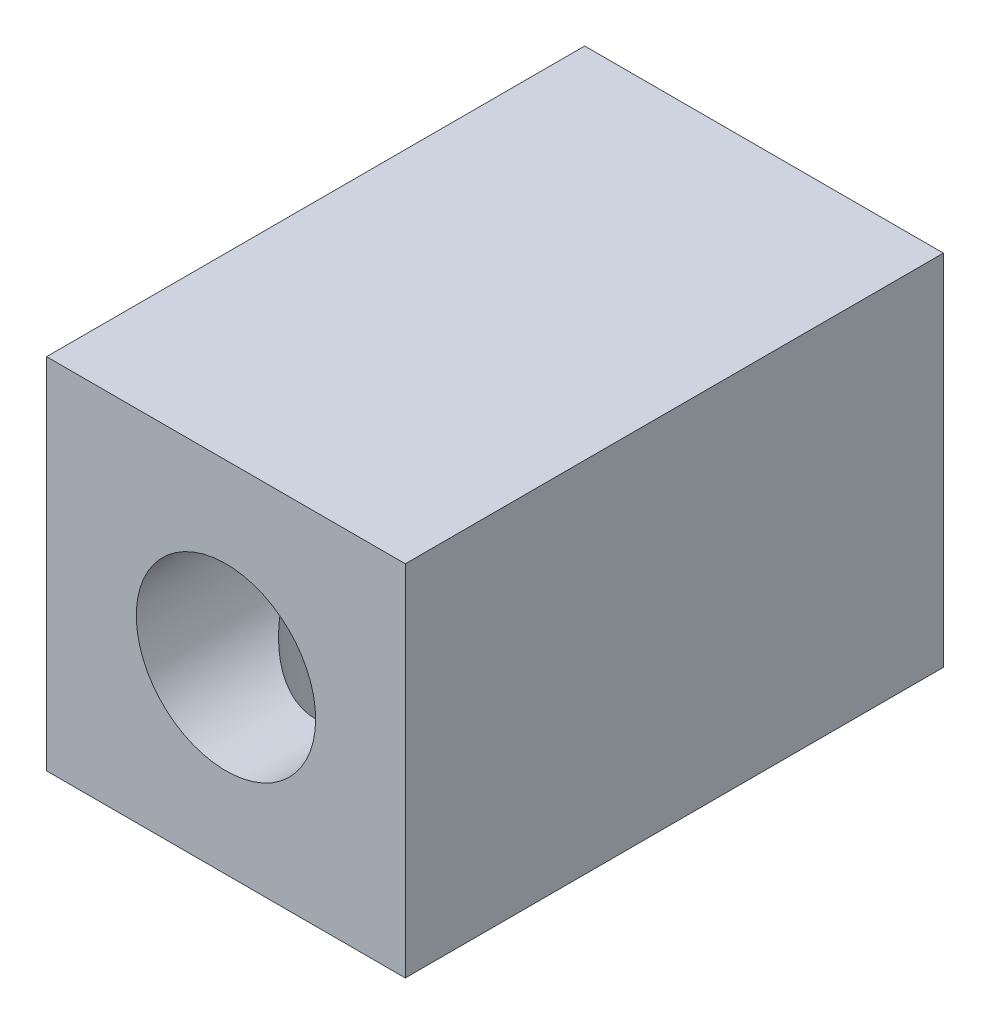
ISO-10303-21;
HEADER;
FILE_DESCRIPTION(('STEP AP214'),'2;1');
FILE_NAME('part.step','',(''),(''),'','','');
FILE_SCHEMA(('AUTOMOTIVE_DESIGN { 1 0 10303 214 1 1 1 1 }'));
ENDSEC;
DATA;
#1=APPLICATION_CONTEXT('core data for automotive mechanical design processes');
#2=APPLICATION_PROTOCOL_DEFINITION('international standard','automotive_design',2000,#1);
#3=PRODUCT_CONTEXT('',#1,'mechanical');
#4=PRODUCT('Part','Part','',(#3));
#5=PRODUCT_RELATED_PRODUCT_CATEGORY('part','',(#4));
#6=PRODUCT_DEFINITION_FORMATION('','',#4);
#7=PRODUCT_DEFINITION_CONTEXT('part definition',#1,'design');
#8=PRODUCT_DEFINITION('design','',#6,#7);
#9=PRODUCT_DEFINITION_SHAPE('','',#8);
#10=(LENGTH_UNIT() NAMED_UNIT(*) SI_UNIT(.MILLI.,.METRE.));
#11=(NAMED_UNIT(*) PLANE_ANGLE_UNIT() SI_UNIT($,.RADIAN.));
#12=(NAMED_UNIT(*) SI_UNIT($,.STERADIAN.) SOLID_ANGLE_UNIT());
#13=UNCERTAINTY_MEASURE_WITH_UNIT(LENGTH_MEASURE(1.E-05),#10,'distance_accuracy_value','');
#14=(GEOMETRIC_REPRESENTATION_CONTEXT(3) GLOBAL_UNCERTAINTY_ASSIGNED_CONTEXT((#13)) GLOBAL_UNIT_ASSIGNED_CONTEXT((#10,
#11,#12)) REPRESENTATION_CONTEXT('',''));
#15=CARTESIAN_POINT('',(0.,0.,0.));
#16=DIRECTION('',(0.,0.,1.));
#17=DIRECTION('',(1.,0.,0.));
#18=AXIS2_PLACEMENT_3D('',#15,#16,#17);
#19=CARTESIAN_POINT('',(-4.99999999999898,-5.00000000000006,15.));
#20=DIRECTION('',(0.,0.,-1.00000000000001));
#21=DIRECTION('',(-1.00000000000002,0.,0.));
#22=AXIS2_PLACEMENT_3D('',#19,#20,#21);
#23=PLANE('',#22);
#24=DIRECTION('',(0.,-1.00000000000001,0.));
#25=VECTOR('',#24,1.);
#26=CARTESIAN_POINT('',(-4.99999999999898,-5.00000000000006,15.));
#27=LINE('',#26,#25);
#28=CARTESIAN_POINT('',(-4.99999999999887,4.99999999999992,15.));
#29=VERTEX_POINT('',#28);
#30=CARTESIAN_POINT('',(-4.99999999999898,-5.00000000000006,15.));
#31=VERTEX_POINT('',#30);
#32=EDGE_CURVE('E91',#29,#31,#27,.T.);
#33=ORIENTED_EDGE('',*,*,#32,.T.);
#34=DIRECTION('',(1.00000000000002,0.,0.));
#35=VECTOR('',#34,1.);
#36=CARTESIAN_POINT('',(-4.99999999999898,-5.00000000000006,15.));
#37=LINE('',#36,#35);
#38=CARTESIAN_POINT('',(4.99999999999972,-5.00000000000009,15.0000000000003));
#39=VERTEX_POINT('',#38);
#40=EDGE_CURVE('E93',#31,#39,#37,.T.);
#41=ORIENTED_EDGE('',*,*,#40,.T.);
#42=DIRECTION('',(0.,1.00000000000001,0.));
#43=VECTOR('',#42,1.);
#44=CARTESIAN_POINT('',(4.99999999999972,-5.00000000000009,15.0000000000003));
#45=LINE('',#44,#43);
#46=CARTESIAN_POINT('',(5.00000000000033,5.00000000000025,15.0000000000003));
#47=VERTEX_POINT('',#46);
#48=EDGE_CURVE('E95',#39,#47,#45,.T.);
#49=ORIENTED_EDGE('',*,*,#48,.T.);
#50=DIRECTION('',(-1.00000000000002,0.,0.));
#51=VECTOR('',#50,1.);
#52=CARTESIAN_POINT('',(-4.99999999999887,4.99999999999992,15.));
#53=LINE('',#52,#51);
#54=EDGE_CURVE('E36',#47,#29,#53,.T.);
#55=ORIENTED_EDGE('',*,*,#54,.T.);
#56=EDGE_LOOP('',(#33,#41,#49,#55));
#57=FACE_BOUND('',#56,.T.);
#58=CARTESIAN_POINT('',(4.30211422042248E-13,0.,15.0000000000005));
#59=DIRECTION('',(0.,0.,1.00000000000001));
#60=DIRECTION('',(1.00000000000002,0.,0.));
#61=AXIS2_PLACEMENT_3D('',#58,#59,#60);
#62=CIRCLE('',#61,2.5);
#63=CARTESIAN_POINT('',(2.50000000000047,0.,15.0000000000005));
#64=VERTEX_POINT('',#63);
#65=EDGE_CURVE('E71',#64,#64,#62,.T.);
#66=ORIENTED_EDGE('',*,*,#65,.F.);
#67=EDGE_LOOP('',(#66));
#68=FACE_BOUND('',#67,.T.);
#69=ADVANCED_FACE('F16',(#57,#68),#23,.F.);
#70=CARTESIAN_POINT('',(-4.99999999999903,-4.99999999999984,1.70002900645727E-13));
#71=DIRECTION('',(0.,0.,-1.00000000000001));
#72=DIRECTION('',(-1.00000000000002,0.,0.));
#73=AXIS2_PLACEMENT_3D('',#70,#71,#72);
#74=PLANE('',#73);
#75=DIRECTION('',(0.,-1.00000000000001,0.));
#76=VECTOR('',#75,1.);
#77=CARTESIAN_POINT('',(-4.99999999999903,-4.99999999999984,1.70002900645727E-13));
#78=LINE('',#77,#76);
#79=CARTESIAN_POINT('',(-5.00000000000006,5.,-1.56125112837913E-13));
#80=VERTEX_POINT('',#79);
#81=CARTESIAN_POINT('',(-4.99999999999903,-4.99999999999984,1.70002900645727E-13));
#82=VERTEX_POINT('',#81);
#83=EDGE_CURVE('E78',#80,#82,#78,.T.);
#84=ORIENTED_EDGE('',*,*,#83,.F.);
#85=DIRECTION('',(-1.00000000000002,0.,0.));
#86=VECTOR('',#85,1.);
#87=CARTESIAN_POINT('',(-5.00000000000006,5.,-1.56125112837913E-13));
#88=LINE('',#87,#86);
#89=CARTESIAN_POINT('',(4.99999999999985,4.99999999999992,0.));
#90=VERTEX_POINT('',#89);
#91=EDGE_CURVE('E89',#90,#80,#88,.T.);
#92=ORIENTED_EDGE('',*,*,#91,.F.);
#93=DIRECTION('',(0.,1.00000000000001,0.));
#94=VECTOR('',#93,1.);
#95=CARTESIAN_POINT('',(5.00000000000004,-4.99999999999998,-2.63677968348475E-13));
#96=LINE('',#95,#94);
#97=CARTESIAN_POINT('',(5.00000000000004,-4.99999999999998,-2.63677968348475E-13));
#98=VERTEX_POINT('',#97);
#99=EDGE_CURVE('E87',#98,#90,#96,.T.);
#100=ORIENTED_EDGE('',*,*,#99,.F.);
#101=DIRECTION('',(1.00000000000002,0.,0.));
#102=VECTOR('',#101,1.);
#103=CARTESIAN_POINT('',(-4.99999999999903,-4.99999999999984,1.70002900645727E-13));
#104=LINE('',#103,#102);
#105=EDGE_CURVE('E85',#82,#98,#104,.T.);
#106=ORIENTED_EDGE('',*,*,#105,.F.);
#107=EDGE_LOOP('',(#84,#92,#100,#106));
#108=FACE_BOUND('',#107,.T.);
#109=CARTESIAN_POINT('',(0.,0.,0.));
#110=DIRECTION('',(0.,0.,1.00000000000001));
#111=DIRECTION('',(1.00000000000002,0.,0.));
#112=AXIS2_PLACEMENT_3D('',#109,#110,#111);
#113=CIRCLE('',#112,2.5);
#114=CARTESIAN_POINT('',(2.50000000000004,0.,0.));
#115=VERTEX_POINT('',#114);
#116=EDGE_CURVE('E74',#115,#115,#113,.T.);
#117=ORIENTED_EDGE('',*,*,#116,.T.);
#118=EDGE_LOOP('',(#117));
#119=FACE_BOUND('',#118,.T.);
#120=ADVANCED_FACE('F117',(#108,#119),#74,.T.);
#121=CARTESIAN_POINT('',(-4.99999999999898,-5.00000000000006,15.));
#122=DIRECTION('',(1.00000000000002,0.,0.));
#123=DIRECTION('',(0.,0.,-1.00000000000001));
#124=AXIS2_PLACEMENT_3D('',#121,#122,#123);
#125=PLANE('',#124);
#126=ORIENTED_EDGE('',*,*,#83,.T.);
#127=DIRECTION('',(0.,0.,-1.00000000000001));
#128=VECTOR('',#127,1.);
#129=CARTESIAN_POINT('',(-4.99999999999898,-5.00000000000006,15.));
#130=LINE('',#129,#128);
#131=EDGE_CURVE('E62',#31,#82,#130,.T.);
#132=ORIENTED_EDGE('',*,*,#131,.F.);
#133=ORIENTED_EDGE('',*,*,#32,.F.);
#134=DIRECTION('',(0.,0.,-1.00000000000001));
#135=VECTOR('',#134,1.);
#136=CARTESIAN_POINT('',(-4.99999999999887,4.99999999999992,15.));
#137=LINE('',#136,#135);
#138=EDGE_CURVE('E98',#29,#80,#137,.T.);
#139=ORIENTED_EDGE('',*,*,#138,.T.);
#140=EDGE_LOOP('',(#126,#132,#133,#139));
#141=FACE_BOUND('',#140,.T.);
#142=ADVANCED_FACE('F18',(#141),#125,.F.);
#143=CARTESIAN_POINT('',(-4.99999999999898,-5.00000000000006,15.));
#144=DIRECTION('',(0.,1.00000000000001,0.));
#145=DIRECTION('',(0.,0.,1.00000000000001));
#146=AXIS2_PLACEMENT_3D('',#143,#144,#145);
#147=PLANE('',#146);
#148=CARTESIAN_POINT('',(5.55111512312578E-13,-4.99999999999998,10.0000000000005));
#149=DIRECTION('',(0.,1.00000000000001,0.));
#150=DIRECTION('',(0.,0.,1.00000000000001));
#151=AXIS2_PLACEMENT_3D('',#148,#149,#150);
#152=CIRCLE('',#151,2.5);
#153=CARTESIAN_POINT('',(5.54309202704939E-13,-4.99999999999997,12.5000000000005));
#154=VERTEX_POINT('',#153);
#155=EDGE_CURVE('E76',#154,#154,#152,.T.);
#156=ORIENTED_EDGE('',*,*,#155,.T.);
#157=EDGE_LOOP('',(#156));
#158=FACE_BOUND('',#157,.T.);
#159=ORIENTED_EDGE('',*,*,#105,.T.);
#160=DIRECTION('',(0.,0.,-1.00000000000001));
#161=VECTOR('',#160,1.);
#162=CARTESIAN_POINT('',(4.99999999999972,-5.00000000000009,15.0000000000003));
#163=LINE('',#162,#161);
#164=EDGE_CURVE('E104',#39,#98,#163,.T.);
#165=ORIENTED_EDGE('',*,*,#164,.F.);
#166=ORIENTED_EDGE('',*,*,#40,.F.);
#167=ORIENTED_EDGE('',*,*,#131,.T.);
#168=EDGE_LOOP('',(#159,#165,#166,#167));
#169=FACE_BOUND('',#168,.T.);
#170=ADVANCED_FACE('F110',(#158,#169),#147,.F.);
#171=CARTESIAN_POINT('',(4.99999999999972,-5.00000000000009,15.0000000000003));
#172=DIRECTION('',(-1.00000000000002,0.,0.));
#173=DIRECTION('',(0.,0.,1.00000000000001));
#174=AXIS2_PLACEMENT_3D('',#171,#172,#173);
#175=PLANE('',#174);
#176=ORIENTED_EDGE('',*,*,#99,.T.);
#177=DIRECTION('',(0.,0.,-1.00000000000001));
#178=VECTOR('',#177,1.);
#179=CARTESIAN_POINT('',(5.00000000000033,5.00000000000025,15.0000000000003));
#180=LINE('',#179,#178);
#181=EDGE_CURVE('E101',#47,#90,#180,.T.);
#182=ORIENTED_EDGE('',*,*,#181,.F.);
#183=ORIENTED_EDGE('',*,*,#48,.F.);
#184=ORIENTED_EDGE('',*,*,#164,.T.);
#185=EDGE_LOOP('',(#176,#182,#183,#184));
#186=FACE_BOUND('',#185,.T.);
#187=ADVANCED_FACE('F121',(#186),#175,.F.);
#188=CARTESIAN_POINT('',(-4.99999999999887,4.99999999999992,15.));
#189=DIRECTION('',(0.,-1.00000000000001,0.));
#190=DIRECTION('',(1.00000000000002,0.,0.));
#191=AXIS2_PLACEMENT_3D('',#188,#189,#190);
#192=PLANE('',#191);
#193=ORIENTED_EDGE('',*,*,#91,.T.);
#194=ORIENTED_EDGE('',*,*,#138,.F.);
#195=ORIENTED_EDGE('',*,*,#54,.F.);
#196=ORIENTED_EDGE('',*,*,#181,.T.);
#197=EDGE_LOOP('',(#193,#194,#195,#196));
#198=FACE_BOUND('',#197,.T.);
#199=ADVANCED_FACE('F66',(#198),#192,.F.);
#200=CARTESIAN_POINT('',(4.30211422042248E-13,0.,15.0000000000005));
#201=DIRECTION('',(0.,0.,-1.00000000000001));
#202=DIRECTION('',(-1.00000000000002,0.,0.));
#203=AXIS2_PLACEMENT_3D('',#200,#201,#202);
#204=CYLINDRICAL_SURFACE('',#203,2.5);
#205=CARTESIAN_POINT('',(6.73072708679001E-13,0.,10.0000000000005));
#206=DIRECTION('',(0.,0.707106781186552,-0.70710678118655));
#207=DIRECTION('',(0.,-0.707106781186555,-0.707106781186556));
#208=AXIS2_PLACEMENT_3D('',#205,#206,#207);
#209=ELLIPSE('',#208,3.53553390593274,2.5);
#210=CARTESIAN_POINT('',(2.50000000000044,0.,9.99999999999893));
#211=VERTEX_POINT('',#210);
#212=CARTESIAN_POINT('',(-2.49999999999974,0.,10.0000000000005));
#213=VERTEX_POINT('',#212);
#214=EDGE_CURVE('E11',#211,#213,#209,.T.);
#215=ORIENTED_EDGE('',*,*,#214,.F.);
#216=CARTESIAN_POINT('',(6.73072708679001E-13,0.,10.0000000000005));
#217=DIRECTION('',(0.,-0.707106781186555,-0.707106781186556));
#218=DIRECTION('',(0.,0.707106781186552,-0.70710678118655));
#219=AXIS2_PLACEMENT_3D('',#216,#217,#218);
#220=ELLIPSE('',#219,3.53553390593274,2.5);
#221=EDGE_CURVE('E24',#213,#211,#220,.F.);
#222=ORIENTED_EDGE('',*,*,#221,.F.);
#223=EDGE_LOOP('',(#215,#222));
#224=FACE_BOUND('',#223,.T.);
#225=ORIENTED_EDGE('',*,*,#65,.T.);
#226=EDGE_LOOP('',(#225));
#227=FACE_BOUND('',#226,.T.);
#228=ORIENTED_EDGE('',*,*,#116,.F.);
#229=EDGE_LOOP('',(#228));
#230=FACE_BOUND('',#229,.T.);
#231=ADVANCED_FACE('F63',(#224,#227,#230),#204,.F.);
#232=CARTESIAN_POINT('',(5.55111512312578E-13,-4.99999999999998,10.0000000000005));
#233=DIRECTION('',(0.,1.00000000000001,0.));
#234=DIRECTION('',(0.,0.,1.00000000000001));
#235=AXIS2_PLACEMENT_3D('',#232,#233,#234);
#236=CYLINDRICAL_SURFACE('',#235,2.5);
#237=ORIENTED_EDGE('',*,*,#214,.T.);
#238=ORIENTED_EDGE('',*,*,#221,.T.);
#239=EDGE_LOOP('',(#237,#238));
#240=FACE_BOUND('',#239,.T.);
#241=ORIENTED_EDGE('',*,*,#155,.F.);
#242=EDGE_LOOP('',(#241));
#243=FACE_BOUND('',#242,.T.);
#244=ADVANCED_FACE('F59',(#240,#243),#236,.F.);
#245=CLOSED_SHELL('',(#69,#120,#142,#170,#187,#199,#231,#244));
#246=MANIFOLD_SOLID_BREP('B1',#245);
#247=ADVANCED_BREP_SHAPE_REPRESENTATION('',(#18,#246),#14);
#248=SHAPE_DEFINITION_REPRESENTATION(#9,#247);
ENDSEC;
END-ISO-10303-21;
